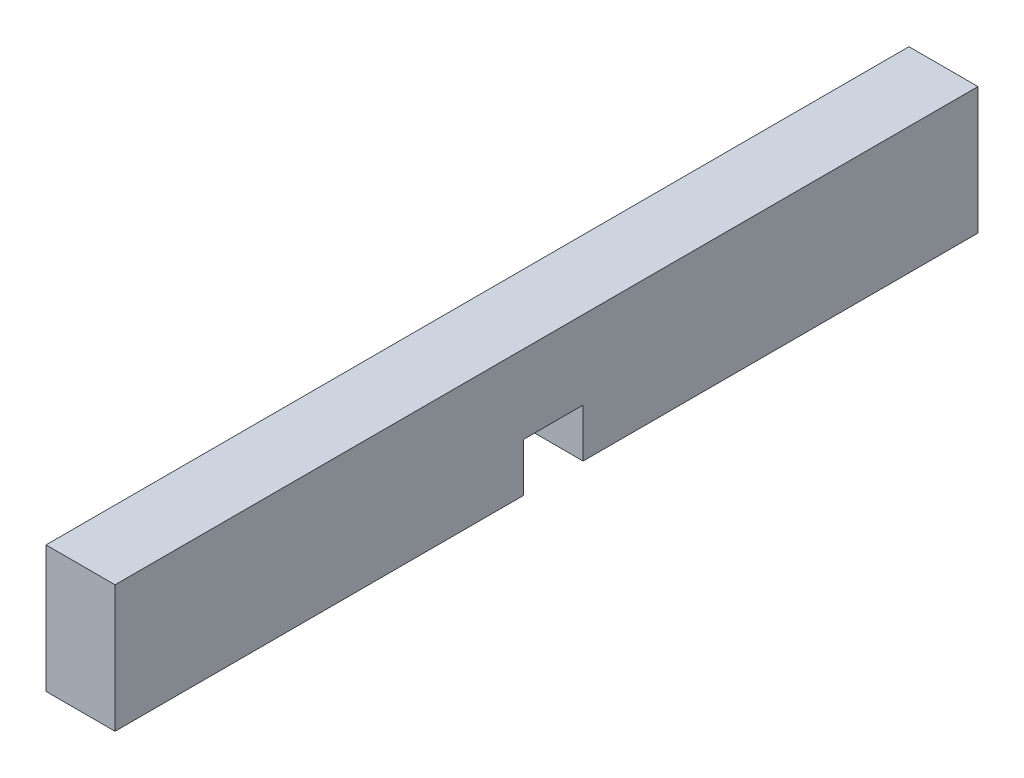
ISO-10303-21;
HEADER;
FILE_DESCRIPTION(('STEP AP214'),'2;1');
FILE_NAME('part.step','',(''),(''),'','','');
FILE_SCHEMA(('AUTOMOTIVE_DESIGN { 1 0 10303 214 1 1 1 1 }'));
ENDSEC;
DATA;
#1=APPLICATION_CONTEXT('core data for automotive mechanical design processes');
#2=APPLICATION_PROTOCOL_DEFINITION('international standard','automotive_design',2000,#1);
#3=PRODUCT_CONTEXT('',#1,'mechanical');
#4=PRODUCT('Part','Part','',(#3));
#5=PRODUCT_RELATED_PRODUCT_CATEGORY('part','',(#4));
#6=PRODUCT_DEFINITION_FORMATION('','',#4);
#7=PRODUCT_DEFINITION_CONTEXT('part definition',#1,'design');
#8=PRODUCT_DEFINITION('design','',#6,#7);
#9=PRODUCT_DEFINITION_SHAPE('','',#8);
#10=(LENGTH_UNIT() NAMED_UNIT(*) SI_UNIT(.MILLI.,.METRE.));
#11=(NAMED_UNIT(*) PLANE_ANGLE_UNIT() SI_UNIT($,.RADIAN.));
#12=(NAMED_UNIT(*) SI_UNIT($,.STERADIAN.) SOLID_ANGLE_UNIT());
#13=UNCERTAINTY_MEASURE_WITH_UNIT(LENGTH_MEASURE(1.E-05),#10,'distance_accuracy_value','');
#14=(GEOMETRIC_REPRESENTATION_CONTEXT(3) GLOBAL_UNCERTAINTY_ASSIGNED_CONTEXT((#13)) GLOBAL_UNIT_ASSIGNED_CONTEXT((#10,
#11,#12)) REPRESENTATION_CONTEXT('',''));
#15=CARTESIAN_POINT('',(0.,0.,0.));
#16=DIRECTION('',(0.,0.,1.));
#17=DIRECTION('',(1.,0.,0.));
#18=AXIS2_PLACEMENT_3D('',#15,#16,#17);
#19=CARTESIAN_POINT('',(2.3495,-4.318,29.3624));
#20=DIRECTION('',(0.,1.,0.));
#21=DIRECTION('',(0.,0.,1.));
#22=AXIS2_PLACEMENT_3D('',#19,#20,#21);
#23=PLANE('',#22);
#24=DIRECTION('',(0.,0.,-1.));
#25=VECTOR('',#24,1.);
#26=CARTESIAN_POINT('',(-2.3495,-4.318,29.3624));
#27=LINE('',#26,#25);
#28=CARTESIAN_POINT('',(-2.3495,-4.318,29.3624));
#29=VERTEX_POINT('',#28);
#30=CARTESIAN_POINT('',(-2.3495,-4.318,1.5748));
#31=VERTEX_POINT('',#30);
#32=EDGE_CURVE('E132',#29,#31,#27,.T.);
#33=ORIENTED_EDGE('',*,*,#32,.T.);
#34=DIRECTION('',(1.,0.,0.));
#35=VECTOR('',#34,1.);
#36=CARTESIAN_POINT('',(-2.3495,-4.318,1.5748));
#37=LINE('',#36,#35);
#38=CARTESIAN_POINT('',(2.3495,-4.318,1.5748));
#39=VERTEX_POINT('',#38);
#40=EDGE_CURVE('E115',#31,#39,#37,.T.);
#41=ORIENTED_EDGE('',*,*,#40,.T.);
#42=DIRECTION('',(0.,0.,-1.));
#43=VECTOR('',#42,1.);
#44=CARTESIAN_POINT('',(2.3495,-4.318,29.3624));
#45=LINE('',#44,#43);
#46=CARTESIAN_POINT('',(2.3495,-4.318,29.3624));
#47=VERTEX_POINT('',#46);
#48=EDGE_CURVE('E154',#47,#39,#45,.T.);
#49=ORIENTED_EDGE('',*,*,#48,.F.);
#50=DIRECTION('',(-1.,0.,0.));
#51=VECTOR('',#50,1.);
#52=CARTESIAN_POINT('',(2.3495,-4.318,29.3624));
#53=LINE('',#52,#51);
#54=EDGE_CURVE('E140',#47,#29,#53,.T.);
#55=ORIENTED_EDGE('',*,*,#54,.T.);
#56=EDGE_LOOP('',(#33,#41,#49,#55));
#57=FACE_BOUND('',#56,.T.);
#58=ADVANCED_FACE('F39',(#57),#23,.F.);
#59=CARTESIAN_POINT('',(2.3495,4.318,-29.3624));
#60=DIRECTION('',(0.,0.,1.));
#61=DIRECTION('',(1.,0.,0.));
#62=AXIS2_PLACEMENT_3D('',#59,#60,#61);
#63=PLANE('',#62);
#64=DIRECTION('',(0.,1.,0.));
#65=VECTOR('',#64,1.);
#66=CARTESIAN_POINT('',(-2.3495,4.318,-29.3624));
#67=LINE('',#66,#65);
#68=CARTESIAN_POINT('',(-2.3495,-4.318,-29.3624));
#69=VERTEX_POINT('',#68);
#70=CARTESIAN_POINT('',(-2.3495,4.318,-29.3624));
#71=VERTEX_POINT('',#70);
#72=EDGE_CURVE('E166',#69,#71,#67,.T.);
#73=ORIENTED_EDGE('',*,*,#72,.T.);
#74=DIRECTION('',(-1.,0.,0.));
#75=VECTOR('',#74,1.);
#76=CARTESIAN_POINT('',(2.3495,4.318,-29.3624));
#77=LINE('',#76,#75);
#78=CARTESIAN_POINT('',(2.3495,4.318,-29.3624));
#79=VERTEX_POINT('',#78);
#80=EDGE_CURVE('E11',#79,#71,#77,.T.);
#81=ORIENTED_EDGE('',*,*,#80,.F.);
#82=DIRECTION('',(0.,1.,0.));
#83=VECTOR('',#82,1.);
#84=CARTESIAN_POINT('',(2.3495,4.318,-29.3624));
#85=LINE('',#84,#83);
#86=CARTESIAN_POINT('',(2.3495,-4.318,-29.3624));
#87=VERTEX_POINT('',#86);
#88=EDGE_CURVE('E142',#87,#79,#85,.T.);
#89=ORIENTED_EDGE('',*,*,#88,.F.);
#90=DIRECTION('',(-1.,0.,0.));
#91=VECTOR('',#90,1.);
#92=CARTESIAN_POINT('',(2.3495,-4.318,-29.3624));
#93=LINE('',#92,#91);
#94=EDGE_CURVE('E151',#87,#69,#93,.T.);
#95=ORIENTED_EDGE('',*,*,#94,.T.);
#96=EDGE_LOOP('',(#73,#81,#89,#95));
#97=FACE_BOUND('',#96,.T.);
#98=ADVANCED_FACE('F41',(#97),#63,.F.);
#99=CARTESIAN_POINT('',(2.3495,4.318,29.3624));
#100=DIRECTION('',(0.,-1.,0.));
#101=DIRECTION('',(0.,0.,-1.));
#102=AXIS2_PLACEMENT_3D('',#99,#100,#101);
#103=PLANE('',#102);
#104=DIRECTION('',(0.,0.,1.));
#105=VECTOR('',#104,1.);
#106=CARTESIAN_POINT('',(-2.3495,4.318,29.3624));
#107=LINE('',#106,#105);
#108=CARTESIAN_POINT('',(-2.3495,4.318,29.3624));
#109=VERTEX_POINT('',#108);
#110=EDGE_CURVE('E163',#71,#109,#107,.T.);
#111=ORIENTED_EDGE('',*,*,#110,.T.);
#112=DIRECTION('',(-1.,0.,0.));
#113=VECTOR('',#112,1.);
#114=CARTESIAN_POINT('',(2.3495,4.318,29.3624));
#115=LINE('',#114,#113);
#116=CARTESIAN_POINT('',(2.3495,4.318,29.3624));
#117=VERTEX_POINT('',#116);
#118=EDGE_CURVE('E48',#117,#109,#115,.T.);
#119=ORIENTED_EDGE('',*,*,#118,.F.);
#120=DIRECTION('',(0.,0.,1.));
#121=VECTOR('',#120,1.);
#122=CARTESIAN_POINT('',(2.3495,4.318,29.3624));
#123=LINE('',#122,#121);
#124=EDGE_CURVE('E93',#79,#117,#123,.T.);
#125=ORIENTED_EDGE('',*,*,#124,.F.);
#126=ORIENTED_EDGE('',*,*,#80,.T.);
#127=EDGE_LOOP('',(#111,#119,#125,#126));
#128=FACE_BOUND('',#127,.T.);
#129=ADVANCED_FACE('F220',(#128),#103,.F.);
#130=CARTESIAN_POINT('',(2.3495,4.318,29.3624));
#131=DIRECTION('',(0.,0.,-1.));
#132=DIRECTION('',(-1.,0.,0.));
#133=AXIS2_PLACEMENT_3D('',#130,#131,#132);
#134=PLANE('',#133);
#135=DIRECTION('',(0.,-1.,0.));
#136=VECTOR('',#135,1.);
#137=CARTESIAN_POINT('',(-2.3495,4.318,29.3624));
#138=LINE('',#137,#136);
#139=EDGE_CURVE('E147',#109,#29,#138,.T.);
#140=ORIENTED_EDGE('',*,*,#139,.T.);
#141=ORIENTED_EDGE('',*,*,#54,.F.);
#142=DIRECTION('',(0.,-1.,0.));
#143=VECTOR('',#142,1.);
#144=CARTESIAN_POINT('',(2.3495,4.318,29.3624));
#145=LINE('',#144,#143);
#146=EDGE_CURVE('E161',#117,#47,#145,.T.);
#147=ORIENTED_EDGE('',*,*,#146,.F.);
#148=ORIENTED_EDGE('',*,*,#118,.T.);
#149=EDGE_LOOP('',(#140,#141,#147,#148));
#150=FACE_BOUND('',#149,.T.);
#151=ADVANCED_FACE('F160',(#150),#134,.F.);
#152=CARTESIAN_POINT('',(2.3495,-4.318,-2.4892));
#153=VERTEX_POINT('',#152);
#154=EDGE_CURVE('E64',#153,#87,#45,.T.);
#155=ORIENTED_EDGE('',*,*,#154,.F.);
#156=DIRECTION('',(1.,0.,0.));
#157=VECTOR('',#156,1.);
#158=CARTESIAN_POINT('',(-2.3495,-4.318,-2.4892));
#159=LINE('',#158,#157);
#160=CARTESIAN_POINT('',(-2.3495,-4.318,-2.4892));
#161=VERTEX_POINT('',#160);
#162=EDGE_CURVE('E126',#161,#153,#159,.T.);
#163=ORIENTED_EDGE('',*,*,#162,.F.);
#164=EDGE_CURVE('E86',#161,#69,#27,.T.);
#165=ORIENTED_EDGE('',*,*,#164,.T.);
#166=ORIENTED_EDGE('',*,*,#94,.F.);
#167=EDGE_LOOP('',(#155,#163,#165,#166));
#168=FACE_BOUND('',#167,.T.);
#169=ADVANCED_FACE('F199',(#168),#23,.F.);
#170=CARTESIAN_POINT('',(2.3495,0.,0.));
#171=DIRECTION('',(1.,0.,0.));
#172=DIRECTION('',(0.,0.,-1.));
#173=AXIS2_PLACEMENT_3D('',#170,#171,#172);
#174=PLANE('',#173);
#175=DIRECTION('',(0.,-1.,0.));
#176=VECTOR('',#175,1.);
#177=CARTESIAN_POINT('',(2.3495,-4.318,1.5748));
#178=LINE('',#177,#176);
#179=CARTESIAN_POINT('',(2.3495,-1.016,1.5748));
#180=VERTEX_POINT('',#179);
#181=EDGE_CURVE('E120',#180,#39,#178,.T.);
#182=ORIENTED_EDGE('',*,*,#181,.F.);
#183=DIRECTION('',(0.,0.,1.));
#184=VECTOR('',#183,1.);
#185=CARTESIAN_POINT('',(2.3495,-1.016,1.5748));
#186=LINE('',#185,#184);
#187=CARTESIAN_POINT('',(2.3495,-1.016,-2.4892));
#188=VERTEX_POINT('',#187);
#189=EDGE_CURVE('E136',#188,#180,#186,.T.);
#190=ORIENTED_EDGE('',*,*,#189,.F.);
#191=DIRECTION('',(0.,1.,0.));
#192=VECTOR('',#191,1.);
#193=CARTESIAN_POINT('',(2.3495,-4.318,-2.4892));
#194=LINE('',#193,#192);
#195=EDGE_CURVE('E188',#153,#188,#194,.T.);
#196=ORIENTED_EDGE('',*,*,#195,.F.);
#197=ORIENTED_EDGE('',*,*,#154,.T.);
#198=ORIENTED_EDGE('',*,*,#88,.T.);
#199=ORIENTED_EDGE('',*,*,#124,.T.);
#200=ORIENTED_EDGE('',*,*,#146,.T.);
#201=ORIENTED_EDGE('',*,*,#48,.T.);
#202=EDGE_LOOP('',(#182,#190,#196,#197,#198,#199,#200,#201));
#203=FACE_BOUND('',#202,.T.);
#204=ADVANCED_FACE('F204',(#203),#174,.T.);
#205=CARTESIAN_POINT('',(-2.3495,0.,0.));
#206=DIRECTION('',(1.,0.,0.));
#207=DIRECTION('',(0.,0.,-1.));
#208=AXIS2_PLACEMENT_3D('',#205,#206,#207);
#209=PLANE('',#208);
#210=DIRECTION('',(0.,0.,1.));
#211=VECTOR('',#210,1.);
#212=CARTESIAN_POINT('',(-2.3495,-1.016,1.5748));
#213=LINE('',#212,#211);
#214=CARTESIAN_POINT('',(-2.3495,-1.016,-2.4892));
#215=VERTEX_POINT('',#214);
#216=CARTESIAN_POINT('',(-2.3495,-1.016,1.5748));
#217=VERTEX_POINT('',#216);
#218=EDGE_CURVE('E55',#215,#217,#213,.T.);
#219=ORIENTED_EDGE('',*,*,#218,.T.);
#220=DIRECTION('',(0.,-1.,0.));
#221=VECTOR('',#220,1.);
#222=CARTESIAN_POINT('',(-2.3495,-4.318,1.5748));
#223=LINE('',#222,#221);
#224=EDGE_CURVE('E118',#217,#31,#223,.T.);
#225=ORIENTED_EDGE('',*,*,#224,.T.);
#226=ORIENTED_EDGE('',*,*,#32,.F.);
#227=ORIENTED_EDGE('',*,*,#139,.F.);
#228=ORIENTED_EDGE('',*,*,#110,.F.);
#229=ORIENTED_EDGE('',*,*,#72,.F.);
#230=ORIENTED_EDGE('',*,*,#164,.F.);
#231=DIRECTION('',(0.,1.,0.));
#232=VECTOR('',#231,1.);
#233=CARTESIAN_POINT('',(-2.3495,-4.318,-2.4892));
#234=LINE('',#233,#232);
#235=EDGE_CURVE('E135',#161,#215,#234,.T.);
#236=ORIENTED_EDGE('',*,*,#235,.T.);
#237=EDGE_LOOP('',(#219,#225,#226,#227,#228,#229,#230,#236));
#238=FACE_BOUND('',#237,.T.);
#239=ADVANCED_FACE('F130',(#238),#209,.F.);
#240=CARTESIAN_POINT('',(-2.3495,-4.318,1.5748));
#241=DIRECTION('',(0.,0.,1.));
#242=DIRECTION('',(1.,0.,0.));
#243=AXIS2_PLACEMENT_3D('',#240,#241,#242);
#244=PLANE('',#243);
#245=ORIENTED_EDGE('',*,*,#181,.T.);
#246=ORIENTED_EDGE('',*,*,#40,.F.);
#247=ORIENTED_EDGE('',*,*,#224,.F.);
#248=DIRECTION('',(1.,0.,0.));
#249=VECTOR('',#248,1.);
#250=CARTESIAN_POINT('',(-2.3495,-1.016,1.5748));
#251=LINE('',#250,#249);
#252=EDGE_CURVE('E169',#217,#180,#251,.T.);
#253=ORIENTED_EDGE('',*,*,#252,.T.);
#254=EDGE_LOOP('',(#245,#246,#247,#253));
#255=FACE_BOUND('',#254,.T.);
#256=ADVANCED_FACE('F117',(#255),#244,.F.);
#257=CARTESIAN_POINT('',(-2.3495,-1.016,1.5748));
#258=DIRECTION('',(0.,1.,0.));
#259=DIRECTION('',(0.,0.,1.));
#260=AXIS2_PLACEMENT_3D('',#257,#258,#259);
#261=PLANE('',#260);
#262=ORIENTED_EDGE('',*,*,#189,.T.);
#263=ORIENTED_EDGE('',*,*,#252,.F.);
#264=ORIENTED_EDGE('',*,*,#218,.F.);
#265=DIRECTION('',(1.,0.,0.));
#266=VECTOR('',#265,1.);
#267=CARTESIAN_POINT('',(-2.3495,-1.016,-2.4892));
#268=LINE('',#267,#266);
#269=EDGE_CURVE('E180',#215,#188,#268,.T.);
#270=ORIENTED_EDGE('',*,*,#269,.T.);
#271=EDGE_LOOP('',(#262,#263,#264,#270));
#272=FACE_BOUND('',#271,.T.);
#273=ADVANCED_FACE('F206',(#272),#261,.F.);
#274=CARTESIAN_POINT('',(-2.3495,-4.318,-2.4892));
#275=DIRECTION('',(0.,0.,-1.));
#276=DIRECTION('',(-1.,0.,0.));
#277=AXIS2_PLACEMENT_3D('',#274,#275,#276);
#278=PLANE('',#277);
#279=ORIENTED_EDGE('',*,*,#195,.T.);
#280=ORIENTED_EDGE('',*,*,#269,.F.);
#281=ORIENTED_EDGE('',*,*,#235,.F.);
#282=ORIENTED_EDGE('',*,*,#162,.T.);
#283=EDGE_LOOP('',(#279,#280,#281,#282));
#284=FACE_BOUND('',#283,.T.);
#285=ADVANCED_FACE('F198',(#284),#278,.F.);
#286=CLOSED_SHELL('',(#58,#98,#129,#151,#169,#204,#239,#256,#273,#285));
#287=MANIFOLD_SOLID_BREP('B2',#286);
#288=ADVANCED_BREP_SHAPE_REPRESENTATION('',(#18,#287),#14);
#289=SHAPE_DEFINITION_REPRESENTATION(#9,#288);
ENDSEC;
END-ISO-10303-21;
